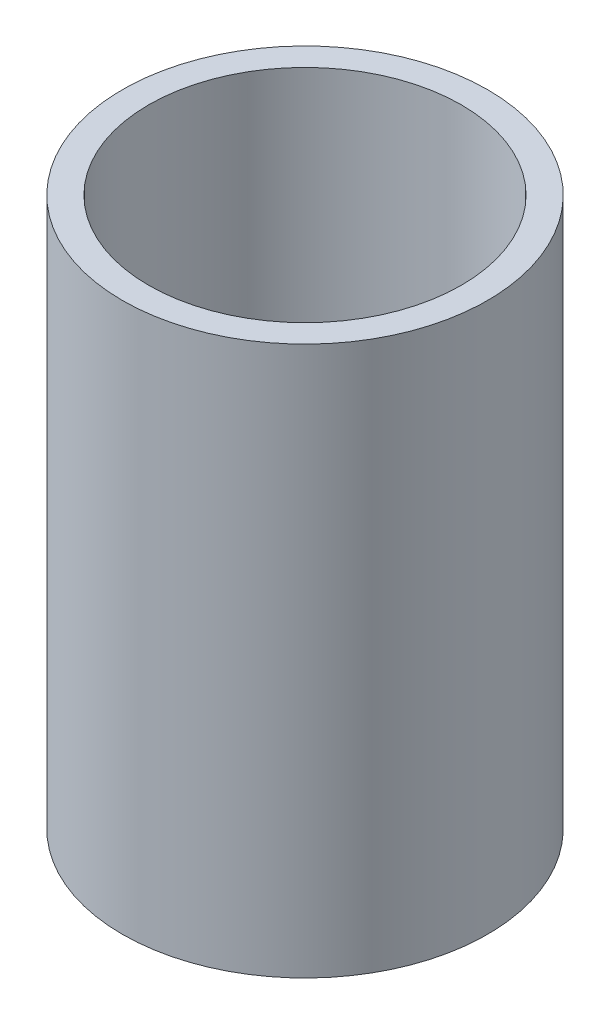
ISO-10303-21;
HEADER;
FILE_DESCRIPTION(('STEP AP214'),'2;1');
FILE_NAME('part.step','',(''),(''),'','','');
FILE_SCHEMA(('AUTOMOTIVE_DESIGN { 1 0 10303 214 1 1 1 1 }'));
ENDSEC;
DATA;
#1=APPLICATION_CONTEXT('core data for automotive mechanical design processes');
#2=APPLICATION_PROTOCOL_DEFINITION('international standard','automotive_design',2000,#1);
#3=PRODUCT_CONTEXT('',#1,'mechanical');
#4=PRODUCT('Part','Part','',(#3));
#5=PRODUCT_RELATED_PRODUCT_CATEGORY('part','',(#4));
#6=PRODUCT_DEFINITION_FORMATION('','',#4);
#7=PRODUCT_DEFINITION_CONTEXT('part definition',#1,'design');
#8=PRODUCT_DEFINITION('design','',#6,#7);
#9=PRODUCT_DEFINITION_SHAPE('','',#8);
#10=(LENGTH_UNIT() NAMED_UNIT(*) SI_UNIT(.MILLI.,.METRE.));
#11=(NAMED_UNIT(*) PLANE_ANGLE_UNIT() SI_UNIT($,.RADIAN.));
#12=(NAMED_UNIT(*) SI_UNIT($,.STERADIAN.) SOLID_ANGLE_UNIT());
#13=UNCERTAINTY_MEASURE_WITH_UNIT(LENGTH_MEASURE(1.E-05),#10,'distance_accuracy_value','');
#14=(GEOMETRIC_REPRESENTATION_CONTEXT(3) GLOBAL_UNCERTAINTY_ASSIGNED_CONTEXT((#13)) GLOBAL_UNIT_ASSIGNED_CONTEXT((#10,
#11,#12)) REPRESENTATION_CONTEXT('',''));
#15=CARTESIAN_POINT('',(0.,0.,0.));
#16=DIRECTION('',(0.,0.,1.));
#17=DIRECTION('',(1.,0.,0.));
#18=AXIS2_PLACEMENT_3D('',#15,#16,#17);
#19=CARTESIAN_POINT('',(0.,105.227514018571,0.));
#20=DIRECTION('',(0.,-1.,0.));
#21=DIRECTION('',(0.,0.,-1.));
#22=AXIS2_PLACEMENT_3D('',#19,#20,#21);
#23=CYLINDRICAL_SURFACE('',#22,35.);
#24=CARTESIAN_POINT('',(0.,105.227514018571,0.));
#25=DIRECTION('',(0.,1.,0.));
#26=DIRECTION('',(0.,0.,1.));
#27=AXIS2_PLACEMENT_3D('',#24,#25,#26);
#28=CIRCLE('',#27,35.);
#29=CARTESIAN_POINT('',(0.,105.227514018571,35.));
#30=VERTEX_POINT('',#29);
#31=EDGE_CURVE('E10',#30,#30,#28,.T.);
#32=ORIENTED_EDGE('',*,*,#31,.F.);
#33=EDGE_LOOP('',(#32));
#34=FACE_BOUND('',#33,.T.);
#35=CARTESIAN_POINT('',(0.,0.,0.));
#36=DIRECTION('',(0.,1.,0.));
#37=DIRECTION('',(0.,0.,1.));
#38=AXIS2_PLACEMENT_3D('',#35,#36,#37);
#39=CIRCLE('',#38,35.);
#40=CARTESIAN_POINT('',(0.,0.,35.));
#41=VERTEX_POINT('',#40);
#42=EDGE_CURVE('E37',#41,#41,#39,.T.);
#43=ORIENTED_EDGE('',*,*,#42,.T.);
#44=EDGE_LOOP('',(#43));
#45=FACE_BOUND('',#44,.T.);
#46=ADVANCED_FACE('F40',(#34,#45),#23,.T.);
#47=CARTESIAN_POINT('',(0.,105.227514018571,0.));
#48=DIRECTION('',(0.,1.,0.));
#49=DIRECTION('',(0.,0.,1.));
#50=AXIS2_PLACEMENT_3D('',#47,#48,#49);
#51=PLANE('',#50);
#52=CARTESIAN_POINT('',(0.,105.227514018571,0.));
#53=DIRECTION('',(0.,1.,0.));
#54=DIRECTION('',(0.,0.,1.));
#55=AXIS2_PLACEMENT_3D('',#52,#53,#54);
#56=CIRCLE('',#55,29.9678938870983);
#57=CARTESIAN_POINT('',(0.,105.227514018571,29.9678938870983));
#58=VERTEX_POINT('',#57);
#59=EDGE_CURVE('E50',#58,#58,#56,.T.);
#60=ORIENTED_EDGE('',*,*,#59,.F.);
#61=EDGE_LOOP('',(#60));
#62=FACE_BOUND('',#61,.T.);
#63=ORIENTED_EDGE('',*,*,#31,.T.);
#64=EDGE_LOOP('',(#63));
#65=FACE_BOUND('',#64,.T.);
#66=ADVANCED_FACE('F59',(#62,#65),#51,.T.);
#67=CARTESIAN_POINT('',(0.,0.,0.));
#68=DIRECTION('',(0.,1.,0.));
#69=DIRECTION('',(0.,0.,1.));
#70=AXIS2_PLACEMENT_3D('',#67,#68,#69);
#71=PLANE('',#70);
#72=CARTESIAN_POINT('',(0.,0.,0.));
#73=DIRECTION('',(0.,1.,0.));
#74=DIRECTION('',(0.,0.,1.));
#75=AXIS2_PLACEMENT_3D('',#72,#73,#74);
#76=CIRCLE('',#75,29.9678938870983);
#77=CARTESIAN_POINT('',(0.,0.,29.9678938870983));
#78=VERTEX_POINT('',#77);
#79=EDGE_CURVE('E47',#78,#78,#76,.T.);
#80=ORIENTED_EDGE('',*,*,#79,.T.);
#81=EDGE_LOOP('',(#80));
#82=FACE_BOUND('',#81,.T.);
#83=ORIENTED_EDGE('',*,*,#42,.F.);
#84=EDGE_LOOP('',(#83));
#85=FACE_BOUND('',#84,.T.);
#86=ADVANCED_FACE('F58',(#82,#85),#71,.F.);
#87=CARTESIAN_POINT('',(0.,105.227514018571,0.));
#88=DIRECTION('',(0.,-1.,0.));
#89=DIRECTION('',(0.,0.,-1.));
#90=AXIS2_PLACEMENT_3D('',#87,#88,#89);
#91=CYLINDRICAL_SURFACE('',#90,29.9678938870983);
#92=ORIENTED_EDGE('',*,*,#59,.T.);
#93=EDGE_LOOP('',(#92));
#94=FACE_BOUND('',#93,.T.);
#95=ORIENTED_EDGE('',*,*,#79,.F.);
#96=EDGE_LOOP('',(#95));
#97=FACE_BOUND('',#96,.T.);
#98=ADVANCED_FACE('F54',(#94,#97),#91,.F.);
#99=CLOSED_SHELL('',(#46,#66,#86,#98));
#100=MANIFOLD_SOLID_BREP('B2',#99);
#101=ADVANCED_BREP_SHAPE_REPRESENTATION('',(#18,#100),#14);
#102=SHAPE_DEFINITION_REPRESENTATION(#9,#101);
ENDSEC;
END-ISO-10303-21;
